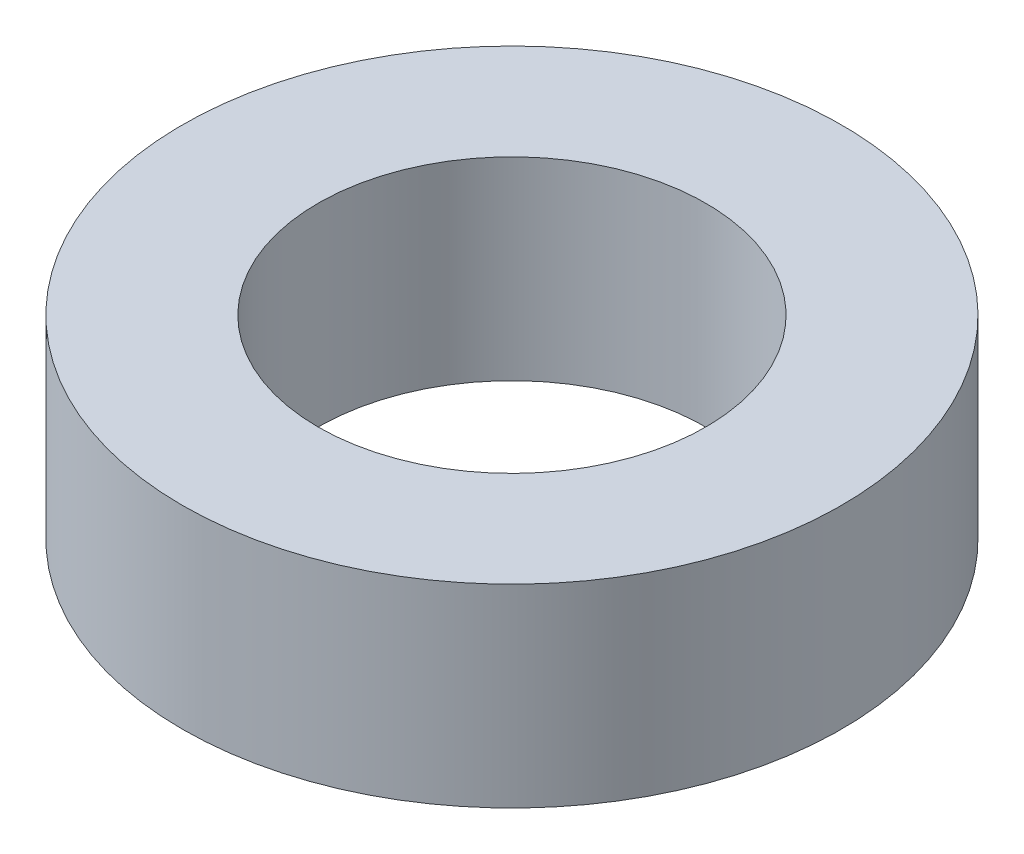
ISO-10303-21;
HEADER;
FILE_DESCRIPTION(('STEP AP214'),'2;1');
FILE_NAME('part.step','',(''),(''),'','','');
FILE_SCHEMA(('AUTOMOTIVE_DESIGN { 1 0 10303 214 1 1 1 1 }'));
ENDSEC;
DATA;
#1=APPLICATION_CONTEXT('core data for automotive mechanical design processes');
#2=APPLICATION_PROTOCOL_DEFINITION('international standard','automotive_design',2000,#1);
#3=PRODUCT_CONTEXT('',#1,'mechanical');
#4=PRODUCT('Part','Part','',(#3));
#5=PRODUCT_RELATED_PRODUCT_CATEGORY('part','',(#4));
#6=PRODUCT_DEFINITION_FORMATION('','',#4);
#7=PRODUCT_DEFINITION_CONTEXT('part definition',#1,'design');
#8=PRODUCT_DEFINITION('design','',#6,#7);
#9=PRODUCT_DEFINITION_SHAPE('','',#8);
#10=(LENGTH_UNIT() NAMED_UNIT(*) SI_UNIT(.MILLI.,.METRE.));
#11=(NAMED_UNIT(*) PLANE_ANGLE_UNIT() SI_UNIT($,.RADIAN.));
#12=(NAMED_UNIT(*) SI_UNIT($,.STERADIAN.) SOLID_ANGLE_UNIT());
#13=UNCERTAINTY_MEASURE_WITH_UNIT(LENGTH_MEASURE(1.E-05),#10,'distance_accuracy_value','');
#14=(GEOMETRIC_REPRESENTATION_CONTEXT(3) GLOBAL_UNCERTAINTY_ASSIGNED_CONTEXT((#13)) GLOBAL_UNIT_ASSIGNED_CONTEXT((#10,
#11,#12)) REPRESENTATION_CONTEXT('',''));
#15=CARTESIAN_POINT('',(0.,0.,0.));
#16=DIRECTION('',(0.,0.,1.));
#17=DIRECTION('',(1.,0.,0.));
#18=AXIS2_PLACEMENT_3D('',#15,#16,#17);
#19=CARTESIAN_POINT('',(0.,25.,0.));
#20=DIRECTION('',(0.,-1.,0.));
#21=DIRECTION('',(0.,0.,-1.));
#22=AXIS2_PLACEMENT_3D('',#19,#20,#21);
#23=CYLINDRICAL_SURFACE('',#22,42.5);
#24=CARTESIAN_POINT('',(0.,25.,0.));
#25=DIRECTION('',(0.,1.,0.));
#26=DIRECTION('',(0.,0.,1.));
#27=AXIS2_PLACEMENT_3D('',#24,#25,#26);
#28=CIRCLE('',#27,42.5);
#29=CARTESIAN_POINT('',(0.,25.,42.5));
#30=VERTEX_POINT('',#29);
#31=EDGE_CURVE('E10',#30,#30,#28,.T.);
#32=ORIENTED_EDGE('',*,*,#31,.F.);
#33=EDGE_LOOP('',(#32));
#34=FACE_BOUND('',#33,.T.);
#35=CARTESIAN_POINT('',(0.,0.,0.));
#36=DIRECTION('',(0.,1.,0.));
#37=DIRECTION('',(0.,0.,1.));
#38=AXIS2_PLACEMENT_3D('',#35,#36,#37);
#39=CIRCLE('',#38,42.5);
#40=CARTESIAN_POINT('',(0.,0.,42.5));
#41=VERTEX_POINT('',#40);
#42=EDGE_CURVE('E37',#41,#41,#39,.T.);
#43=ORIENTED_EDGE('',*,*,#42,.T.);
#44=EDGE_LOOP('',(#43));
#45=FACE_BOUND('',#44,.T.);
#46=ADVANCED_FACE('F40',(#34,#45),#23,.T.);
#47=CARTESIAN_POINT('',(0.,25.,0.));
#48=DIRECTION('',(0.,1.,0.));
#49=DIRECTION('',(0.,0.,1.));
#50=AXIS2_PLACEMENT_3D('',#47,#48,#49);
#51=PLANE('',#50);
#52=CARTESIAN_POINT('',(0.,25.,0.));
#53=DIRECTION('',(0.,1.,0.));
#54=DIRECTION('',(0.,0.,1.));
#55=AXIS2_PLACEMENT_3D('',#52,#53,#54);
#56=CIRCLE('',#55,25.);
#57=CARTESIAN_POINT('',(0.,25.,25.));
#58=VERTEX_POINT('',#57);
#59=EDGE_CURVE('E50',#58,#58,#56,.T.);
#60=ORIENTED_EDGE('',*,*,#59,.F.);
#61=EDGE_LOOP('',(#60));
#62=FACE_BOUND('',#61,.T.);
#63=ORIENTED_EDGE('',*,*,#31,.T.);
#64=EDGE_LOOP('',(#63));
#65=FACE_BOUND('',#64,.T.);
#66=ADVANCED_FACE('F59',(#62,#65),#51,.T.);
#67=CARTESIAN_POINT('',(0.,0.,0.));
#68=DIRECTION('',(0.,1.,0.));
#69=DIRECTION('',(0.,0.,1.));
#70=AXIS2_PLACEMENT_3D('',#67,#68,#69);
#71=PLANE('',#70);
#72=CARTESIAN_POINT('',(0.,0.,0.));
#73=DIRECTION('',(0.,1.,0.));
#74=DIRECTION('',(0.,0.,1.));
#75=AXIS2_PLACEMENT_3D('',#72,#73,#74);
#76=CIRCLE('',#75,25.);
#77=CARTESIAN_POINT('',(0.,0.,25.));
#78=VERTEX_POINT('',#77);
#79=EDGE_CURVE('E47',#78,#78,#76,.T.);
#80=ORIENTED_EDGE('',*,*,#79,.T.);
#81=EDGE_LOOP('',(#80));
#82=FACE_BOUND('',#81,.T.);
#83=ORIENTED_EDGE('',*,*,#42,.F.);
#84=EDGE_LOOP('',(#83));
#85=FACE_BOUND('',#84,.T.);
#86=ADVANCED_FACE('F58',(#82,#85),#71,.F.);
#87=CARTESIAN_POINT('',(0.,25.,0.));
#88=DIRECTION('',(0.,-1.,0.));
#89=DIRECTION('',(0.,0.,-1.));
#90=AXIS2_PLACEMENT_3D('',#87,#88,#89);
#91=CYLINDRICAL_SURFACE('',#90,25.);
#92=ORIENTED_EDGE('',*,*,#59,.T.);
#93=EDGE_LOOP('',(#92));
#94=FACE_BOUND('',#93,.T.);
#95=ORIENTED_EDGE('',*,*,#79,.F.);
#96=EDGE_LOOP('',(#95));
#97=FACE_BOUND('',#96,.T.);
#98=ADVANCED_FACE('F54',(#94,#97),#91,.F.);
#99=CLOSED_SHELL('',(#46,#66,#86,#98));
#100=MANIFOLD_SOLID_BREP('B2',#99);
#101=ADVANCED_BREP_SHAPE_REPRESENTATION('',(#18,#100),#14);
#102=SHAPE_DEFINITION_REPRESENTATION(#9,#101);
ENDSEC;
END-ISO-10303-21;
